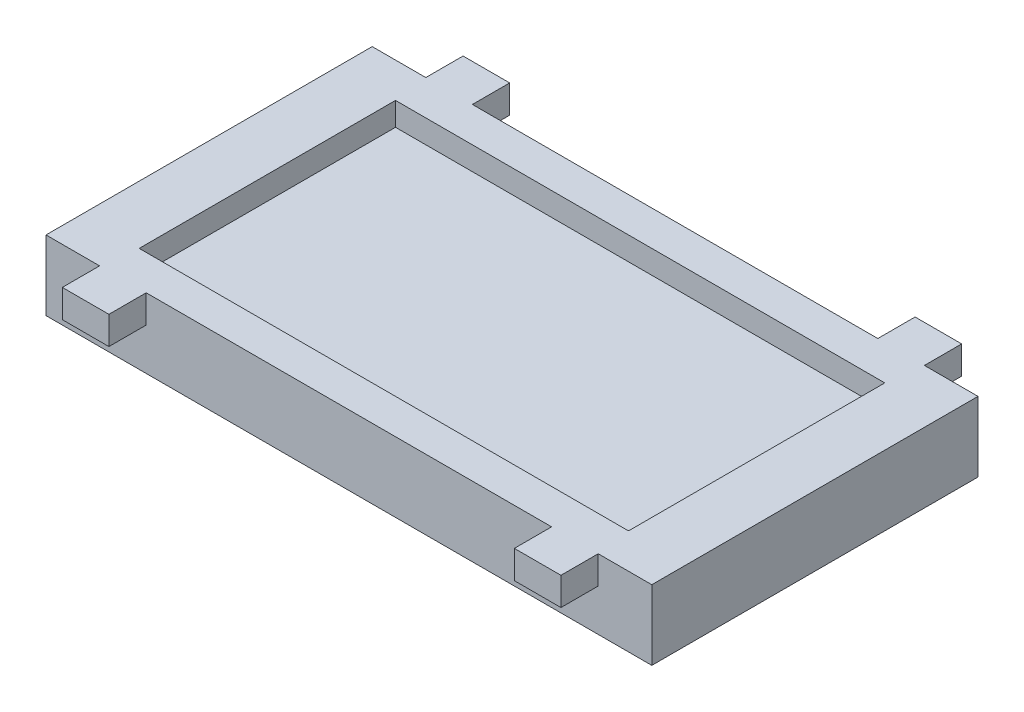
ISO-10303-21;
HEADER;
FILE_DESCRIPTION(('STEP AP214'),'2;1');
FILE_NAME('part.step','',(''),(''),'','','');
FILE_SCHEMA(('AUTOMOTIVE_DESIGN { 1 0 10303 214 1 1 1 1 }'));
ENDSEC;
DATA;
#1=APPLICATION_CONTEXT('core data for automotive mechanical design processes');
#2=APPLICATION_PROTOCOL_DEFINITION('international standard','automotive_design',2000,#1);
#3=PRODUCT_CONTEXT('',#1,'mechanical');
#4=PRODUCT('Part','Part','',(#3));
#5=PRODUCT_RELATED_PRODUCT_CATEGORY('part','',(#4));
#6=PRODUCT_DEFINITION_FORMATION('','',#4);
#7=PRODUCT_DEFINITION_CONTEXT('part definition',#1,'design');
#8=PRODUCT_DEFINITION('design','',#6,#7);
#9=PRODUCT_DEFINITION_SHAPE('','',#8);
#10=(LENGTH_UNIT() NAMED_UNIT(*) SI_UNIT(.MILLI.,.METRE.));
#11=(NAMED_UNIT(*) PLANE_ANGLE_UNIT() SI_UNIT($,.RADIAN.));
#12=(NAMED_UNIT(*) SI_UNIT($,.STERADIAN.) SOLID_ANGLE_UNIT());
#13=UNCERTAINTY_MEASURE_WITH_UNIT(LENGTH_MEASURE(1.E-05),#10,'distance_accuracy_value','');
#14=(GEOMETRIC_REPRESENTATION_CONTEXT(3) GLOBAL_UNCERTAINTY_ASSIGNED_CONTEXT((#13)) GLOBAL_UNIT_ASSIGNED_CONTEXT((#10,
#11,#12)) REPRESENTATION_CONTEXT('',''));
#15=CARTESIAN_POINT('',(0.,0.,0.));
#16=DIRECTION('',(0.,0.,1.));
#17=DIRECTION('',(1.,0.,0.));
#18=AXIS2_PLACEMENT_3D('',#15,#16,#17);
#19=CARTESIAN_POINT('',(-650.,150.,-350.));
#20=DIRECTION('',(0.,0.,1.));
#21=DIRECTION('',(1.,0.,0.));
#22=AXIS2_PLACEMENT_3D('',#19,#20,#21);
#23=PLANE('',#22);
#24=DIRECTION('',(-1.,0.,0.));
#25=VECTOR('',#24,1.);
#26=CARTESIAN_POINT('',(-650.,150.,-350.));
#27=LINE('',#26,#25);
#28=CARTESIAN_POINT('',(-535.,150.,-350.));
#29=VERTEX_POINT('',#28);
#30=CARTESIAN_POINT('',(-650.,150.,-350.));
#31=VERTEX_POINT('',#30);
#32=EDGE_CURVE('E554',#29,#31,#27,.T.);
#33=ORIENTED_EDGE('',*,*,#32,.F.);
#34=DIRECTION('',(0.,1.,0.));
#35=VECTOR('',#34,1.);
#36=CARTESIAN_POINT('',(-535.,90.,-350.));
#37=LINE('',#36,#35);
#38=CARTESIAN_POINT('',(-535.,90.,-350.));
#39=VERTEX_POINT('',#38);
#40=EDGE_CURVE('E267',#39,#29,#37,.T.);
#41=ORIENTED_EDGE('',*,*,#40,.F.);
#42=DIRECTION('',(1.,0.,0.));
#43=VECTOR('',#42,1.);
#44=CARTESIAN_POINT('',(-535.,90.,-350.));
#45=LINE('',#44,#43);
#46=CARTESIAN_POINT('',(-435.,90.,-350.));
#47=VERTEX_POINT('',#46);
#48=EDGE_CURVE('E279',#39,#47,#45,.T.);
#49=ORIENTED_EDGE('',*,*,#48,.T.);
#50=DIRECTION('',(0.,1.,0.));
#51=VECTOR('',#50,1.);
#52=CARTESIAN_POINT('',(-435.,90.,-350.));
#53=LINE('',#52,#51);
#54=CARTESIAN_POINT('',(-435.,150.,-350.));
#55=VERTEX_POINT('',#54);
#56=EDGE_CURVE('E293',#47,#55,#53,.T.);
#57=ORIENTED_EDGE('',*,*,#56,.T.);
#58=CARTESIAN_POINT('',(435.,150.,-350.));
#59=VERTEX_POINT('',#58);
#60=EDGE_CURVE('E561',#59,#55,#27,.T.);
#61=ORIENTED_EDGE('',*,*,#60,.F.);
#62=DIRECTION('',(0.,1.,0.));
#63=VECTOR('',#62,1.);
#64=CARTESIAN_POINT('',(435.,90.,-350.));
#65=LINE('',#64,#63);
#66=CARTESIAN_POINT('',(435.,90.,-350.));
#67=VERTEX_POINT('',#66);
#68=EDGE_CURVE('E316',#67,#59,#65,.T.);
#69=ORIENTED_EDGE('',*,*,#68,.F.);
#70=DIRECTION('',(1.,0.,0.));
#71=VECTOR('',#70,1.);
#72=CARTESIAN_POINT('',(435.,90.,-350.));
#73=LINE('',#72,#71);
#74=CARTESIAN_POINT('',(535.,90.,-350.));
#75=VERTEX_POINT('',#74);
#76=EDGE_CURVE('E303',#67,#75,#73,.T.);
#77=ORIENTED_EDGE('',*,*,#76,.T.);
#78=DIRECTION('',(0.,1.,0.));
#79=VECTOR('',#78,1.);
#80=CARTESIAN_POINT('',(535.,90.,-350.));
#81=LINE('',#80,#79);
#82=CARTESIAN_POINT('',(535.,150.,-350.));
#83=VERTEX_POINT('',#82);
#84=EDGE_CURVE('E332',#75,#83,#81,.T.);
#85=ORIENTED_EDGE('',*,*,#84,.T.);
#86=CARTESIAN_POINT('',(650.,150.,-350.));
#87=VERTEX_POINT('',#86);
#88=EDGE_CURVE('E556',#87,#83,#27,.T.);
#89=ORIENTED_EDGE('',*,*,#88,.F.);
#90=DIRECTION('',(0.,-1.,0.));
#91=VECTOR('',#90,1.);
#92=CARTESIAN_POINT('',(650.,150.,-350.));
#93=LINE('',#92,#91);
#94=CARTESIAN_POINT('',(650.,0.,-350.));
#95=VERTEX_POINT('',#94);
#96=EDGE_CURVE('E11',#87,#95,#93,.T.);
#97=ORIENTED_EDGE('',*,*,#96,.T.);
#98=DIRECTION('',(-1.,0.,0.));
#99=VECTOR('',#98,1.);
#100=CARTESIAN_POINT('',(-650.,0.,-350.));
#101=LINE('',#100,#99);
#102=CARTESIAN_POINT('',(-650.,0.,-350.));
#103=VERTEX_POINT('',#102);
#104=EDGE_CURVE('E574',#95,#103,#101,.T.);
#105=ORIENTED_EDGE('',*,*,#104,.T.);
#106=DIRECTION('',(0.,-1.,0.));
#107=VECTOR('',#106,1.);
#108=CARTESIAN_POINT('',(-650.,150.,-350.));
#109=LINE('',#108,#107);
#110=EDGE_CURVE('E54',#31,#103,#109,.T.);
#111=ORIENTED_EDGE('',*,*,#110,.F.);
#112=EDGE_LOOP('',(#33,#41,#49,#57,#61,#69,#77,#85,#89,#97,#105,#111));
#113=FACE_BOUND('',#112,.T.);
#114=ADVANCED_FACE('F45',(#113),#23,.F.);
#115=CARTESIAN_POINT('',(-650.,150.,350.));
#116=DIRECTION('',(0.,0.,-1.));
#117=DIRECTION('',(-1.,0.,0.));
#118=AXIS2_PLACEMENT_3D('',#115,#116,#117);
#119=PLANE('',#118);
#120=DIRECTION('',(1.,0.,0.));
#121=VECTOR('',#120,1.);
#122=CARTESIAN_POINT('',(-650.,150.,350.));
#123=LINE('',#122,#121);
#124=CARTESIAN_POINT('',(-435.,150.,350.));
#125=VERTEX_POINT('',#124);
#126=CARTESIAN_POINT('',(435.,150.,350.));
#127=VERTEX_POINT('',#126);
#128=EDGE_CURVE('E570',#125,#127,#123,.T.);
#129=ORIENTED_EDGE('',*,*,#128,.F.);
#130=DIRECTION('',(0.,1.,0.));
#131=VECTOR('',#130,1.);
#132=CARTESIAN_POINT('',(-435.,90.,350.));
#133=LINE('',#132,#131);
#134=CARTESIAN_POINT('',(-435.,90.,350.));
#135=VERTEX_POINT('',#134);
#136=EDGE_CURVE('E381',#135,#125,#133,.T.);
#137=ORIENTED_EDGE('',*,*,#136,.F.);
#138=DIRECTION('',(-1.,0.,0.));
#139=VECTOR('',#138,1.);
#140=CARTESIAN_POINT('',(-435.,90.,350.));
#141=LINE('',#140,#139);
#142=CARTESIAN_POINT('',(-535.,90.,350.));
#143=VERTEX_POINT('',#142);
#144=EDGE_CURVE('E415',#135,#143,#141,.T.);
#145=ORIENTED_EDGE('',*,*,#144,.T.);
#146=DIRECTION('',(0.,1.,0.));
#147=VECTOR('',#146,1.);
#148=CARTESIAN_POINT('',(-535.,90.,350.));
#149=LINE('',#148,#147);
#150=CARTESIAN_POINT('',(-535.,150.,350.));
#151=VERTEX_POINT('',#150);
#152=EDGE_CURVE('E386',#143,#151,#149,.T.);
#153=ORIENTED_EDGE('',*,*,#152,.T.);
#154=CARTESIAN_POINT('',(-650.,150.,350.));
#155=VERTEX_POINT('',#154);
#156=EDGE_CURVE('E565',#155,#151,#123,.T.);
#157=ORIENTED_EDGE('',*,*,#156,.F.);
#158=DIRECTION('',(0.,-1.,0.));
#159=VECTOR('',#158,1.);
#160=CARTESIAN_POINT('',(-650.,150.,350.));
#161=LINE('',#160,#159);
#162=CARTESIAN_POINT('',(-650.,0.,350.));
#163=VERTEX_POINT('',#162);
#164=EDGE_CURVE('E585',#155,#163,#161,.T.);
#165=ORIENTED_EDGE('',*,*,#164,.T.);
#166=DIRECTION('',(1.,0.,0.));
#167=VECTOR('',#166,1.);
#168=CARTESIAN_POINT('',(-650.,0.,350.));
#169=LINE('',#168,#167);
#170=CARTESIAN_POINT('',(650.,0.,350.));
#171=VERTEX_POINT('',#170);
#172=EDGE_CURVE('E555',#163,#171,#169,.T.);
#173=ORIENTED_EDGE('',*,*,#172,.T.);
#174=DIRECTION('',(0.,-1.,0.));
#175=VECTOR('',#174,1.);
#176=CARTESIAN_POINT('',(650.,150.,350.));
#177=LINE('',#176,#175);
#178=CARTESIAN_POINT('',(650.,150.,350.));
#179=VERTEX_POINT('',#178);
#180=EDGE_CURVE('E569',#179,#171,#177,.T.);
#181=ORIENTED_EDGE('',*,*,#180,.F.);
#182=CARTESIAN_POINT('',(535.,150.,350.));
#183=VERTEX_POINT('',#182);
#184=EDGE_CURVE('E564',#183,#179,#123,.T.);
#185=ORIENTED_EDGE('',*,*,#184,.F.);
#186=DIRECTION('',(0.,1.,0.));
#187=VECTOR('',#186,1.);
#188=CARTESIAN_POINT('',(535.,90.,350.));
#189=LINE('',#188,#187);
#190=CARTESIAN_POINT('',(535.,90.,350.));
#191=VERTEX_POINT('',#190);
#192=EDGE_CURVE('E450',#191,#183,#189,.T.);
#193=ORIENTED_EDGE('',*,*,#192,.F.);
#194=DIRECTION('',(-1.,0.,0.));
#195=VECTOR('',#194,1.);
#196=CARTESIAN_POINT('',(435.,90.,350.));
#197=LINE('',#196,#195);
#198=CARTESIAN_POINT('',(435.,90.,350.));
#199=VERTEX_POINT('',#198);
#200=EDGE_CURVE('E422',#191,#199,#197,.T.);
#201=ORIENTED_EDGE('',*,*,#200,.T.);
#202=DIRECTION('',(0.,1.,0.));
#203=VECTOR('',#202,1.);
#204=CARTESIAN_POINT('',(435.,90.,350.));
#205=LINE('',#204,#203);
#206=EDGE_CURVE('E439',#199,#127,#205,.T.);
#207=ORIENTED_EDGE('',*,*,#206,.T.);
#208=EDGE_LOOP('',(#129,#137,#145,#153,#157,#165,#173,#181,#185,#193,#201,#207));
#209=FACE_BOUND('',#208,.T.);
#210=ADVANCED_FACE('F604',(#209),#119,.F.);
#211=CARTESIAN_POINT('',(650.,150.,350.));
#212=DIRECTION('',(-1.,0.,0.));
#213=DIRECTION('',(0.,0.,1.));
#214=AXIS2_PLACEMENT_3D('',#211,#212,#213);
#215=PLANE('',#214);
#216=DIRECTION('',(0.,0.,-1.));
#217=VECTOR('',#216,1.);
#218=CARTESIAN_POINT('',(650.,0.,350.));
#219=LINE('',#218,#217);
#220=EDGE_CURVE('E541',#171,#95,#219,.T.);
#221=ORIENTED_EDGE('',*,*,#220,.T.);
#222=ORIENTED_EDGE('',*,*,#96,.F.);
#223=DIRECTION('',(0.,0.,-1.));
#224=VECTOR('',#223,1.);
#225=CARTESIAN_POINT('',(650.,150.,350.));
#226=LINE('',#225,#224);
#227=EDGE_CURVE('E551',#179,#87,#226,.T.);
#228=ORIENTED_EDGE('',*,*,#227,.F.);
#229=ORIENTED_EDGE('',*,*,#180,.T.);
#230=EDGE_LOOP('',(#221,#222,#228,#229));
#231=FACE_BOUND('',#230,.T.);
#232=ADVANCED_FACE('F47',(#231),#215,.F.);
#233=CARTESIAN_POINT('',(-650.,150.,350.));
#234=DIRECTION('',(1.,0.,0.));
#235=DIRECTION('',(0.,0.,-1.));
#236=AXIS2_PLACEMENT_3D('',#233,#234,#235);
#237=PLANE('',#236);
#238=DIRECTION('',(0.,0.,1.));
#239=VECTOR('',#238,1.);
#240=CARTESIAN_POINT('',(-650.,0.,350.));
#241=LINE('',#240,#239);
#242=EDGE_CURVE('E577',#103,#163,#241,.T.);
#243=ORIENTED_EDGE('',*,*,#242,.T.);
#244=ORIENTED_EDGE('',*,*,#164,.F.);
#245=DIRECTION('',(0.,0.,1.));
#246=VECTOR('',#245,1.);
#247=CARTESIAN_POINT('',(-650.,150.,350.));
#248=LINE('',#247,#246);
#249=EDGE_CURVE('E560',#31,#155,#248,.T.);
#250=ORIENTED_EDGE('',*,*,#249,.F.);
#251=ORIENTED_EDGE('',*,*,#110,.T.);
#252=EDGE_LOOP('',(#243,#244,#250,#251));
#253=FACE_BOUND('',#252,.T.);
#254=ADVANCED_FACE('F594',(#253),#237,.F.);
#255=CARTESIAN_POINT('',(0.,150.,0.));
#256=DIRECTION('',(0.,-1.,0.));
#257=DIRECTION('',(0.,0.,-1.));
#258=AXIS2_PLACEMENT_3D('',#255,#256,#257);
#259=PLANE('',#258);
#260=DIRECTION('',(-1.,0.,0.));
#261=VECTOR('',#260,1.);
#262=CARTESIAN_POINT('',(-525.,150.,-275.));
#263=LINE('',#262,#261);
#264=CARTESIAN_POINT('',(525.,150.,-275.));
#265=VERTEX_POINT('',#264);
#266=CARTESIAN_POINT('',(-525.,150.,-275.));
#267=VERTEX_POINT('',#266);
#268=EDGE_CURVE('E527',#265,#267,#263,.T.);
#269=ORIENTED_EDGE('',*,*,#268,.F.);
#270=DIRECTION('',(0.,0.,-1.));
#271=VECTOR('',#270,1.);
#272=CARTESIAN_POINT('',(525.,150.,275.));
#273=LINE('',#272,#271);
#274=CARTESIAN_POINT('',(525.,150.,275.));
#275=VERTEX_POINT('',#274);
#276=EDGE_CURVE('E497',#275,#265,#273,.T.);
#277=ORIENTED_EDGE('',*,*,#276,.F.);
#278=DIRECTION('',(1.,0.,0.));
#279=VECTOR('',#278,1.);
#280=CARTESIAN_POINT('',(-525.,150.,275.));
#281=LINE('',#280,#279);
#282=CARTESIAN_POINT('',(-525.,150.,275.));
#283=VERTEX_POINT('',#282);
#284=EDGE_CURVE('E512',#283,#275,#281,.T.);
#285=ORIENTED_EDGE('',*,*,#284,.F.);
#286=DIRECTION('',(0.,0.,1.));
#287=VECTOR('',#286,1.);
#288=CARTESIAN_POINT('',(-525.,150.,275.));
#289=LINE('',#288,#287);
#290=EDGE_CURVE('E531',#267,#283,#289,.T.);
#291=ORIENTED_EDGE('',*,*,#290,.F.);
#292=EDGE_LOOP('',(#269,#277,#285,#291));
#293=FACE_BOUND('',#292,.T.);
#294=ORIENTED_EDGE('',*,*,#227,.T.);
#295=ORIENTED_EDGE('',*,*,#88,.T.);
#296=DIRECTION('',(0.,0.,-1.));
#297=VECTOR('',#296,1.);
#298=CARTESIAN_POINT('',(535.,150.,-430.));
#299=LINE('',#298,#297);
#300=CARTESIAN_POINT('',(535.,150.,-430.));
#301=VERTEX_POINT('',#300);
#302=EDGE_CURVE('E69',#83,#301,#299,.T.);
#303=ORIENTED_EDGE('',*,*,#302,.T.);
#304=DIRECTION('',(-1.,0.,0.));
#305=VECTOR('',#304,1.);
#306=CARTESIAN_POINT('',(535.,150.,-430.));
#307=LINE('',#306,#305);
#308=CARTESIAN_POINT('',(435.,150.,-430.));
#309=VERTEX_POINT('',#308);
#310=EDGE_CURVE('E304',#301,#309,#307,.T.);
#311=ORIENTED_EDGE('',*,*,#310,.T.);
#312=DIRECTION('',(0.,0.,1.));
#313=VECTOR('',#312,1.);
#314=CARTESIAN_POINT('',(435.,150.,-430.));
#315=LINE('',#314,#313);
#316=EDGE_CURVE('E289',#309,#59,#315,.T.);
#317=ORIENTED_EDGE('',*,*,#316,.T.);
#318=ORIENTED_EDGE('',*,*,#60,.T.);
#319=DIRECTION('',(0.,0.,-1.));
#320=VECTOR('',#319,1.);
#321=CARTESIAN_POINT('',(-435.,150.,-350.));
#322=LINE('',#321,#320);
#323=CARTESIAN_POINT('',(-435.,150.,-430.));
#324=VERTEX_POINT('',#323);
#325=EDGE_CURVE('E272',#55,#324,#322,.T.);
#326=ORIENTED_EDGE('',*,*,#325,.T.);
#327=DIRECTION('',(-1.,0.,0.));
#328=VECTOR('',#327,1.);
#329=CARTESIAN_POINT('',(-435.,150.,-430.));
#330=LINE('',#329,#328);
#331=CARTESIAN_POINT('',(-535.,150.,-430.));
#332=VERTEX_POINT('',#331);
#333=EDGE_CURVE('E258',#324,#332,#330,.T.);
#334=ORIENTED_EDGE('',*,*,#333,.T.);
#335=DIRECTION('',(0.,0.,1.));
#336=VECTOR('',#335,1.);
#337=CARTESIAN_POINT('',(-535.,150.,-430.));
#338=LINE('',#337,#336);
#339=EDGE_CURVE('E61',#332,#29,#338,.T.);
#340=ORIENTED_EDGE('',*,*,#339,.T.);
#341=ORIENTED_EDGE('',*,*,#32,.T.);
#342=ORIENTED_EDGE('',*,*,#249,.T.);
#343=ORIENTED_EDGE('',*,*,#156,.T.);
#344=DIRECTION('',(0.,0.,1.));
#345=VECTOR('',#344,1.);
#346=CARTESIAN_POINT('',(-535.,150.,350.));
#347=LINE('',#346,#345);
#348=CARTESIAN_POINT('',(-535.,150.,430.));
#349=VERTEX_POINT('',#348);
#350=EDGE_CURVE('E399',#151,#349,#347,.T.);
#351=ORIENTED_EDGE('',*,*,#350,.T.);
#352=DIRECTION('',(1.,0.,0.));
#353=VECTOR('',#352,1.);
#354=CARTESIAN_POINT('',(-535.,150.,430.));
#355=LINE('',#354,#353);
#356=CARTESIAN_POINT('',(-435.,150.,430.));
#357=VERTEX_POINT('',#356);
#358=EDGE_CURVE('E395',#349,#357,#355,.T.);
#359=ORIENTED_EDGE('',*,*,#358,.T.);
#360=DIRECTION('',(0.,0.,-1.));
#361=VECTOR('',#360,1.);
#362=CARTESIAN_POINT('',(-435.,150.,430.));
#363=LINE('',#362,#361);
#364=EDGE_CURVE('E404',#357,#125,#363,.T.);
#365=ORIENTED_EDGE('',*,*,#364,.T.);
#366=ORIENTED_EDGE('',*,*,#128,.T.);
#367=DIRECTION('',(0.,0.,1.));
#368=VECTOR('',#367,1.);
#369=CARTESIAN_POINT('',(435.,150.,430.));
#370=LINE('',#369,#368);
#371=CARTESIAN_POINT('',(435.,150.,430.));
#372=VERTEX_POINT('',#371);
#373=EDGE_CURVE('E407',#127,#372,#370,.T.);
#374=ORIENTED_EDGE('',*,*,#373,.T.);
#375=DIRECTION('',(1.,0.,0.));
#376=VECTOR('',#375,1.);
#377=CARTESIAN_POINT('',(535.,150.,430.));
#378=LINE('',#377,#376);
#379=CARTESIAN_POINT('',(535.,150.,430.));
#380=VERTEX_POINT('',#379);
#381=EDGE_CURVE('E443',#372,#380,#378,.T.);
#382=ORIENTED_EDGE('',*,*,#381,.T.);
#383=DIRECTION('',(0.,0.,-1.));
#384=VECTOR('',#383,1.);
#385=CARTESIAN_POINT('',(535.,150.,350.));
#386=LINE('',#385,#384);
#387=EDGE_CURVE('E427',#380,#183,#386,.T.);
#388=ORIENTED_EDGE('',*,*,#387,.T.);
#389=ORIENTED_EDGE('',*,*,#184,.T.);
#390=EDGE_LOOP('',(#294,#295,#303,#311,#317,#318,#326,#334,#340,#341,#342,#343,#351,#359,#365,
#366,#374,#382,#388,#389));
#391=FACE_BOUND('',#390,.T.);
#392=ADVANCED_FACE('F270',(#293,#391),#259,.F.);
#393=CARTESIAN_POINT('',(0.,0.,0.));
#394=DIRECTION('',(0.,-1.,0.));
#395=DIRECTION('',(0.,0.,-1.));
#396=AXIS2_PLACEMENT_3D('',#393,#394,#395);
#397=PLANE('',#396);
#398=DIRECTION('',(0.,0.,1.));
#399=VECTOR('',#398,1.);
#400=CARTESIAN_POINT('',(525.,0.,275.));
#401=LINE('',#400,#399);
#402=CARTESIAN_POINT('',(525.,0.,-275.));
#403=VERTEX_POINT('',#402);
#404=CARTESIAN_POINT('',(525.,0.,275.));
#405=VERTEX_POINT('',#404);
#406=EDGE_CURVE('E453',#403,#405,#401,.T.);
#407=ORIENTED_EDGE('',*,*,#406,.F.);
#408=DIRECTION('',(1.,0.,0.));
#409=VECTOR('',#408,1.);
#410=CARTESIAN_POINT('',(-525.,0.,-275.));
#411=LINE('',#410,#409);
#412=CARTESIAN_POINT('',(-525.,0.,-275.));
#413=VERTEX_POINT('',#412);
#414=EDGE_CURVE('E468',#413,#403,#411,.T.);
#415=ORIENTED_EDGE('',*,*,#414,.F.);
#416=DIRECTION('',(0.,0.,-1.));
#417=VECTOR('',#416,1.);
#418=CARTESIAN_POINT('',(-525.,0.,275.));
#419=LINE('',#418,#417);
#420=CARTESIAN_POINT('',(-525.,0.,275.));
#421=VERTEX_POINT('',#420);
#422=EDGE_CURVE('E487',#421,#413,#419,.T.);
#423=ORIENTED_EDGE('',*,*,#422,.F.);
#424=DIRECTION('',(-1.,0.,0.));
#425=VECTOR('',#424,1.);
#426=CARTESIAN_POINT('',(-525.,0.,275.));
#427=LINE('',#426,#425);
#428=EDGE_CURVE('E483',#405,#421,#427,.T.);
#429=ORIENTED_EDGE('',*,*,#428,.F.);
#430=EDGE_LOOP('',(#407,#415,#423,#429));
#431=FACE_BOUND('',#430,.T.);
#432=ORIENTED_EDGE('',*,*,#220,.F.);
#433=ORIENTED_EDGE('',*,*,#172,.F.);
#434=ORIENTED_EDGE('',*,*,#242,.F.);
#435=ORIENTED_EDGE('',*,*,#104,.F.);
#436=EDGE_LOOP('',(#432,#433,#434,#435));
#437=FACE_BOUND('',#436,.T.);
#438=ADVANCED_FACE('F600',(#431,#437),#397,.T.);
#439=CARTESIAN_POINT('',(525.,100.,275.));
#440=DIRECTION('',(1.,0.,0.));
#441=DIRECTION('',(0.,0.,-1.));
#442=AXIS2_PLACEMENT_3D('',#439,#440,#441);
#443=PLANE('',#442);
#444=ORIENTED_EDGE('',*,*,#276,.T.);
#445=DIRECTION('',(0.,1.,0.));
#446=VECTOR('',#445,1.);
#447=CARTESIAN_POINT('',(525.,100.,-275.));
#448=LINE('',#447,#446);
#449=CARTESIAN_POINT('',(525.,100.,-275.));
#450=VERTEX_POINT('',#449);
#451=EDGE_CURVE('E524',#450,#265,#448,.T.);
#452=ORIENTED_EDGE('',*,*,#451,.F.);
#453=DIRECTION('',(0.,0.,-1.));
#454=VECTOR('',#453,1.);
#455=CARTESIAN_POINT('',(525.,100.,275.));
#456=LINE('',#455,#454);
#457=CARTESIAN_POINT('',(525.,100.,275.));
#458=VERTEX_POINT('',#457);
#459=EDGE_CURVE('E507',#458,#450,#456,.T.);
#460=ORIENTED_EDGE('',*,*,#459,.F.);
#461=DIRECTION('',(0.,1.,0.));
#462=VECTOR('',#461,1.);
#463=CARTESIAN_POINT('',(525.,100.,275.));
#464=LINE('',#463,#462);
#465=EDGE_CURVE('E538',#458,#275,#464,.T.);
#466=ORIENTED_EDGE('',*,*,#465,.T.);
#467=EDGE_LOOP('',(#444,#452,#460,#466));
#468=FACE_BOUND('',#467,.T.);
#469=ADVANCED_FACE('F648',(#468),#443,.F.);
#470=CARTESIAN_POINT('',(-525.,100.,275.));
#471=DIRECTION('',(0.,0.,1.));
#472=DIRECTION('',(1.,0.,0.));
#473=AXIS2_PLACEMENT_3D('',#470,#471,#472);
#474=PLANE('',#473);
#475=ORIENTED_EDGE('',*,*,#284,.T.);
#476=ORIENTED_EDGE('',*,*,#465,.F.);
#477=DIRECTION('',(1.,0.,0.));
#478=VECTOR('',#477,1.);
#479=CARTESIAN_POINT('',(-525.,100.,275.));
#480=LINE('',#479,#478);
#481=CARTESIAN_POINT('',(-525.,100.,275.));
#482=VERTEX_POINT('',#481);
#483=EDGE_CURVE('E520',#482,#458,#480,.T.);
#484=ORIENTED_EDGE('',*,*,#483,.F.);
#485=DIRECTION('',(0.,1.,0.));
#486=VECTOR('',#485,1.);
#487=CARTESIAN_POINT('',(-525.,100.,275.));
#488=LINE('',#487,#486);
#489=EDGE_CURVE('E542',#482,#283,#488,.T.);
#490=ORIENTED_EDGE('',*,*,#489,.T.);
#491=EDGE_LOOP('',(#475,#476,#484,#490));
#492=FACE_BOUND('',#491,.T.);
#493=ADVANCED_FACE('F655',(#492),#474,.F.);
#494=CARTESIAN_POINT('',(-525.,100.,275.));
#495=DIRECTION('',(-1.,0.,0.));
#496=DIRECTION('',(0.,0.,1.));
#497=AXIS2_PLACEMENT_3D('',#494,#495,#496);
#498=PLANE('',#497);
#499=ORIENTED_EDGE('',*,*,#290,.T.);
#500=ORIENTED_EDGE('',*,*,#489,.F.);
#501=DIRECTION('',(0.,0.,1.));
#502=VECTOR('',#501,1.);
#503=CARTESIAN_POINT('',(-525.,100.,275.));
#504=LINE('',#503,#502);
#505=CARTESIAN_POINT('',(-525.,100.,-275.));
#506=VERTEX_POINT('',#505);
#507=EDGE_CURVE('E516',#506,#482,#504,.T.);
#508=ORIENTED_EDGE('',*,*,#507,.F.);
#509=DIRECTION('',(0.,1.,0.));
#510=VECTOR('',#509,1.);
#511=CARTESIAN_POINT('',(-525.,100.,-275.));
#512=LINE('',#511,#510);
#513=EDGE_CURVE('E545',#506,#267,#512,.T.);
#514=ORIENTED_EDGE('',*,*,#513,.T.);
#515=EDGE_LOOP('',(#499,#500,#508,#514));
#516=FACE_BOUND('',#515,.T.);
#517=ADVANCED_FACE('F661',(#516),#498,.F.);
#518=CARTESIAN_POINT('',(-525.,100.,-275.));
#519=DIRECTION('',(0.,0.,-1.));
#520=DIRECTION('',(-1.,0.,0.));
#521=AXIS2_PLACEMENT_3D('',#518,#519,#520);
#522=PLANE('',#521);
#523=ORIENTED_EDGE('',*,*,#268,.T.);
#524=ORIENTED_EDGE('',*,*,#513,.F.);
#525=DIRECTION('',(-1.,0.,0.));
#526=VECTOR('',#525,1.);
#527=CARTESIAN_POINT('',(-525.,100.,-275.));
#528=LINE('',#527,#526);
#529=EDGE_CURVE('E511',#450,#506,#528,.T.);
#530=ORIENTED_EDGE('',*,*,#529,.F.);
#531=ORIENTED_EDGE('',*,*,#451,.T.);
#532=EDGE_LOOP('',(#523,#524,#530,#531));
#533=FACE_BOUND('',#532,.T.);
#534=ADVANCED_FACE('F657',(#533),#522,.F.);
#535=CARTESIAN_POINT('',(0.,100.,0.));
#536=DIRECTION('',(0.,-1.,0.));
#537=DIRECTION('',(0.,0.,-1.));
#538=AXIS2_PLACEMENT_3D('',#535,#536,#537);
#539=PLANE('',#538);
#540=ORIENTED_EDGE('',*,*,#459,.T.);
#541=ORIENTED_EDGE('',*,*,#529,.T.);
#542=ORIENTED_EDGE('',*,*,#507,.T.);
#543=ORIENTED_EDGE('',*,*,#483,.T.);
#544=EDGE_LOOP('',(#540,#541,#542,#543));
#545=FACE_BOUND('',#544,.T.);
#546=ADVANCED_FACE('F660',(#545),#539,.F.);
#547=CARTESIAN_POINT('',(525.,50.,275.));
#548=DIRECTION('',(1.,0.,0.));
#549=DIRECTION('',(0.,0.,-1.));
#550=AXIS2_PLACEMENT_3D('',#547,#548,#549);
#551=PLANE('',#550);
#552=ORIENTED_EDGE('',*,*,#406,.T.);
#553=DIRECTION('',(0.,-1.,0.));
#554=VECTOR('',#553,1.);
#555=CARTESIAN_POINT('',(525.,50.,275.));
#556=LINE('',#555,#554);
#557=CARTESIAN_POINT('',(525.,50.,275.));
#558=VERTEX_POINT('',#557);
#559=EDGE_CURVE('E480',#558,#405,#556,.T.);
#560=ORIENTED_EDGE('',*,*,#559,.F.);
#561=DIRECTION('',(0.,0.,1.));
#562=VECTOR('',#561,1.);
#563=CARTESIAN_POINT('',(525.,50.,275.));
#564=LINE('',#563,#562);
#565=CARTESIAN_POINT('',(525.,50.,-275.));
#566=VERTEX_POINT('',#565);
#567=EDGE_CURVE('E463',#566,#558,#564,.T.);
#568=ORIENTED_EDGE('',*,*,#567,.F.);
#569=DIRECTION('',(0.,-1.,0.));
#570=VECTOR('',#569,1.);
#571=CARTESIAN_POINT('',(525.,50.,-275.));
#572=LINE('',#571,#570);
#573=EDGE_CURVE('E494',#566,#403,#572,.T.);
#574=ORIENTED_EDGE('',*,*,#573,.T.);
#575=EDGE_LOOP('',(#552,#560,#568,#574));
#576=FACE_BOUND('',#575,.T.);
#577=ADVANCED_FACE('F671',(#576),#551,.F.);
#578=CARTESIAN_POINT('',(-525.,50.,-275.));
#579=DIRECTION('',(0.,0.,-1.));
#580=DIRECTION('',(-1.,0.,0.));
#581=AXIS2_PLACEMENT_3D('',#578,#579,#580);
#582=PLANE('',#581);
#583=ORIENTED_EDGE('',*,*,#414,.T.);
#584=ORIENTED_EDGE('',*,*,#573,.F.);
#585=DIRECTION('',(1.,0.,0.));
#586=VECTOR('',#585,1.);
#587=CARTESIAN_POINT('',(-525.,50.,-275.));
#588=LINE('',#587,#586);
#589=CARTESIAN_POINT('',(-525.,50.,-275.));
#590=VERTEX_POINT('',#589);
#591=EDGE_CURVE('E476',#590,#566,#588,.T.);
#592=ORIENTED_EDGE('',*,*,#591,.F.);
#593=DIRECTION('',(0.,-1.,0.));
#594=VECTOR('',#593,1.);
#595=CARTESIAN_POINT('',(-525.,50.,-275.));
#596=LINE('',#595,#594);
#597=EDGE_CURVE('E498',#590,#413,#596,.T.);
#598=ORIENTED_EDGE('',*,*,#597,.T.);
#599=EDGE_LOOP('',(#583,#584,#592,#598));
#600=FACE_BOUND('',#599,.T.);
#601=ADVANCED_FACE('F675',(#600),#582,.F.);
#602=CARTESIAN_POINT('',(-525.,50.,275.));
#603=DIRECTION('',(-1.,0.,0.));
#604=DIRECTION('',(0.,0.,1.));
#605=AXIS2_PLACEMENT_3D('',#602,#603,#604);
#606=PLANE('',#605);
#607=ORIENTED_EDGE('',*,*,#422,.T.);
#608=ORIENTED_EDGE('',*,*,#597,.F.);
#609=DIRECTION('',(0.,0.,-1.));
#610=VECTOR('',#609,1.);
#611=CARTESIAN_POINT('',(-525.,50.,275.));
#612=LINE('',#611,#610);
#613=CARTESIAN_POINT('',(-525.,50.,275.));
#614=VERTEX_POINT('',#613);
#615=EDGE_CURVE('E472',#614,#590,#612,.T.);
#616=ORIENTED_EDGE('',*,*,#615,.F.);
#617=DIRECTION('',(0.,-1.,0.));
#618=VECTOR('',#617,1.);
#619=CARTESIAN_POINT('',(-525.,50.,275.));
#620=LINE('',#619,#618);
#621=EDGE_CURVE('E501',#614,#421,#620,.T.);
#622=ORIENTED_EDGE('',*,*,#621,.T.);
#623=EDGE_LOOP('',(#607,#608,#616,#622));
#624=FACE_BOUND('',#623,.T.);
#625=ADVANCED_FACE('F680',(#624),#606,.F.);
#626=CARTESIAN_POINT('',(-525.,50.,275.));
#627=DIRECTION('',(0.,0.,1.));
#628=DIRECTION('',(1.,0.,0.));
#629=AXIS2_PLACEMENT_3D('',#626,#627,#628);
#630=PLANE('',#629);
#631=ORIENTED_EDGE('',*,*,#428,.T.);
#632=ORIENTED_EDGE('',*,*,#621,.F.);
#633=DIRECTION('',(-1.,0.,0.));
#634=VECTOR('',#633,1.);
#635=CARTESIAN_POINT('',(-525.,50.,275.));
#636=LINE('',#635,#634);
#637=EDGE_CURVE('E467',#558,#614,#636,.T.);
#638=ORIENTED_EDGE('',*,*,#637,.F.);
#639=ORIENTED_EDGE('',*,*,#559,.T.);
#640=EDGE_LOOP('',(#631,#632,#638,#639));
#641=FACE_BOUND('',#640,.T.);
#642=ADVANCED_FACE('F677',(#641),#630,.F.);
#643=CARTESIAN_POINT('',(0.,50.,0.));
#644=DIRECTION('',(0.,-1.,0.));
#645=DIRECTION('',(0.,0.,-1.));
#646=AXIS2_PLACEMENT_3D('',#643,#644,#645);
#647=PLANE('',#646);
#648=ORIENTED_EDGE('',*,*,#567,.T.);
#649=ORIENTED_EDGE('',*,*,#637,.T.);
#650=ORIENTED_EDGE('',*,*,#615,.T.);
#651=ORIENTED_EDGE('',*,*,#591,.T.);
#652=EDGE_LOOP('',(#648,#649,#650,#651));
#653=FACE_BOUND('',#652,.T.);
#654=ADVANCED_FACE('F636',(#653),#647,.T.);
#655=CARTESIAN_POINT('',(535.,90.,350.));
#656=DIRECTION('',(1.,0.,0.));
#657=DIRECTION('',(0.,0.,-1.));
#658=AXIS2_PLACEMENT_3D('',#655,#656,#657);
#659=PLANE('',#658);
#660=ORIENTED_EDGE('',*,*,#387,.F.);
#661=DIRECTION('',(0.,1.,0.));
#662=VECTOR('',#661,1.);
#663=CARTESIAN_POINT('',(535.,90.,430.));
#664=LINE('',#663,#662);
#665=CARTESIAN_POINT('',(535.,90.,430.));
#666=VERTEX_POINT('',#665);
#667=EDGE_CURVE('E454',#666,#380,#664,.T.);
#668=ORIENTED_EDGE('',*,*,#667,.F.);
#669=DIRECTION('',(0.,0.,-1.));
#670=VECTOR('',#669,1.);
#671=CARTESIAN_POINT('',(535.,90.,350.));
#672=LINE('',#671,#670);
#673=EDGE_CURVE('E435',#666,#191,#672,.T.);
#674=ORIENTED_EDGE('',*,*,#673,.T.);
#675=ORIENTED_EDGE('',*,*,#192,.T.);
#676=EDGE_LOOP('',(#660,#668,#674,#675));
#677=FACE_BOUND('',#676,.T.);
#678=ADVANCED_FACE('F626',(#677),#659,.T.);
#679=CARTESIAN_POINT('',(535.,90.,430.));
#680=DIRECTION('',(0.,0.,1.));
#681=DIRECTION('',(1.,0.,0.));
#682=AXIS2_PLACEMENT_3D('',#679,#680,#681);
#683=PLANE('',#682);
#684=ORIENTED_EDGE('',*,*,#381,.F.);
#685=DIRECTION('',(0.,1.,0.));
#686=VECTOR('',#685,1.);
#687=CARTESIAN_POINT('',(435.,90.,430.));
#688=LINE('',#687,#686);
#689=CARTESIAN_POINT('',(435.,90.,430.));
#690=VERTEX_POINT('',#689);
#691=EDGE_CURVE('E457',#690,#372,#688,.T.);
#692=ORIENTED_EDGE('',*,*,#691,.F.);
#693=DIRECTION('',(1.,0.,0.));
#694=VECTOR('',#693,1.);
#695=CARTESIAN_POINT('',(535.,90.,430.));
#696=LINE('',#695,#694);
#697=EDGE_CURVE('E431',#690,#666,#696,.T.);
#698=ORIENTED_EDGE('',*,*,#697,.T.);
#699=ORIENTED_EDGE('',*,*,#667,.T.);
#700=EDGE_LOOP('',(#684,#692,#698,#699));
#701=FACE_BOUND('',#700,.T.);
#702=ADVANCED_FACE('F628',(#701),#683,.T.);
#703=CARTESIAN_POINT('',(435.,90.,430.));
#704=DIRECTION('',(-1.,0.,0.));
#705=DIRECTION('',(0.,0.,1.));
#706=AXIS2_PLACEMENT_3D('',#703,#704,#705);
#707=PLANE('',#706);
#708=ORIENTED_EDGE('',*,*,#373,.F.);
#709=ORIENTED_EDGE('',*,*,#206,.F.);
#710=DIRECTION('',(0.,0.,1.));
#711=VECTOR('',#710,1.);
#712=CARTESIAN_POINT('',(435.,90.,430.));
#713=LINE('',#712,#711);
#714=EDGE_CURVE('E426',#199,#690,#713,.T.);
#715=ORIENTED_EDGE('',*,*,#714,.T.);
#716=ORIENTED_EDGE('',*,*,#691,.T.);
#717=EDGE_LOOP('',(#708,#709,#715,#716));
#718=FACE_BOUND('',#717,.T.);
#719=ADVANCED_FACE('F618',(#718),#707,.T.);
#720=CARTESIAN_POINT('',(0.,90.,0.));
#721=DIRECTION('',(0.,-1.,0.));
#722=DIRECTION('',(0.,0.,-1.));
#723=AXIS2_PLACEMENT_3D('',#720,#721,#722);
#724=PLANE('',#723);
#725=DIRECTION('',(0.,0.,1.));
#726=VECTOR('',#725,1.);
#727=CARTESIAN_POINT('',(532.087200578599,90.,362.424483471284));
#728=LINE('',#727,#726);
#729=CARTESIAN_POINT('',(532.087200578599,90.,362.424483471284));
#730=VERTEX_POINT('',#729);
#731=CARTESIAN_POINT('',(532.087200578599,90.,417.424483471284));
#732=VERTEX_POINT('',#731);
#733=EDGE_CURVE('E328',#730,#732,#728,.T.);
#734=ORIENTED_EDGE('',*,*,#733,.F.);
#735=DIRECTION('',(1.,0.,0.));
#736=VECTOR('',#735,1.);
#737=CARTESIAN_POINT('',(439.087200578599,90.,362.424483471284));
#738=LINE('',#737,#736);
#739=CARTESIAN_POINT('',(439.087200578599,90.,362.424483471284));
#740=VERTEX_POINT('',#739);
#741=EDGE_CURVE('E342',#740,#730,#738,.T.);
#742=ORIENTED_EDGE('',*,*,#741,.F.);
#743=DIRECTION('',(0.,0.,-1.));
#744=VECTOR('',#743,1.);
#745=CARTESIAN_POINT('',(439.087200578599,90.,362.424483471284));
#746=LINE('',#745,#744);
#747=CARTESIAN_POINT('',(439.087200578599,90.,417.424483471284));
#748=VERTEX_POINT('',#747);
#749=EDGE_CURVE('E361',#748,#740,#746,.T.);
#750=ORIENTED_EDGE('',*,*,#749,.F.);
#751=DIRECTION('',(-1.,0.,0.));
#752=VECTOR('',#751,1.);
#753=CARTESIAN_POINT('',(439.087200578599,90.,417.424483471284));
#754=LINE('',#753,#752);
#755=EDGE_CURVE('E357',#732,#748,#754,.T.);
#756=ORIENTED_EDGE('',*,*,#755,.F.);
#757=EDGE_LOOP('',(#734,#742,#750,#756));
#758=FACE_BOUND('',#757,.T.);
#759=ORIENTED_EDGE('',*,*,#200,.F.);
#760=ORIENTED_EDGE('',*,*,#673,.F.);
#761=ORIENTED_EDGE('',*,*,#697,.F.);
#762=ORIENTED_EDGE('',*,*,#714,.F.);
#763=EDGE_LOOP('',(#759,#760,#761,#762));
#764=FACE_BOUND('',#763,.T.);
#765=ADVANCED_FACE('F623',(#758,#764),#724,.T.);
#766=CARTESIAN_POINT('',(-435.,90.,430.));
#767=DIRECTION('',(1.,0.,0.));
#768=DIRECTION('',(0.,0.,-1.));
#769=AXIS2_PLACEMENT_3D('',#766,#767,#768);
#770=PLANE('',#769);
#771=ORIENTED_EDGE('',*,*,#364,.F.);
#772=DIRECTION('',(0.,1.,0.));
#773=VECTOR('',#772,1.);
#774=CARTESIAN_POINT('',(-435.,90.,430.));
#775=LINE('',#774,#773);
#776=CARTESIAN_POINT('',(-435.,90.,430.));
#777=VERTEX_POINT('',#776);
#778=EDGE_CURVE('E371',#777,#357,#775,.T.);
#779=ORIENTED_EDGE('',*,*,#778,.F.);
#780=DIRECTION('',(0.,0.,-1.));
#781=VECTOR('',#780,1.);
#782=CARTESIAN_POINT('',(-435.,90.,430.));
#783=LINE('',#782,#781);
#784=EDGE_CURVE('E400',#777,#135,#783,.T.);
#785=ORIENTED_EDGE('',*,*,#784,.T.);
#786=ORIENTED_EDGE('',*,*,#136,.T.);
#787=EDGE_LOOP('',(#771,#779,#785,#786));
#788=FACE_BOUND('',#787,.T.);
#789=ADVANCED_FACE('F730',(#788),#770,.T.);
#790=CARTESIAN_POINT('',(-535.,90.,430.));
#791=DIRECTION('',(0.,0.,1.));
#792=DIRECTION('',(1.,0.,0.));
#793=AXIS2_PLACEMENT_3D('',#790,#791,#792);
#794=PLANE('',#793);
#795=ORIENTED_EDGE('',*,*,#358,.F.);
#796=DIRECTION('',(0.,1.,0.));
#797=VECTOR('',#796,1.);
#798=CARTESIAN_POINT('',(-535.,90.,430.));
#799=LINE('',#798,#797);
#800=CARTESIAN_POINT('',(-535.,90.,430.));
#801=VERTEX_POINT('',#800);
#802=EDGE_CURVE('E390',#801,#349,#799,.T.);
#803=ORIENTED_EDGE('',*,*,#802,.F.);
#804=DIRECTION('',(1.,0.,0.));
#805=VECTOR('',#804,1.);
#806=CARTESIAN_POINT('',(-535.,90.,430.));
#807=LINE('',#806,#805);
#808=EDGE_CURVE('E385',#801,#777,#807,.T.);
#809=ORIENTED_EDGE('',*,*,#808,.T.);
#810=ORIENTED_EDGE('',*,*,#778,.T.);
#811=EDGE_LOOP('',(#795,#803,#809,#810));
#812=FACE_BOUND('',#811,.T.);
#813=ADVANCED_FACE('F735',(#812),#794,.T.);
#814=CARTESIAN_POINT('',(-535.,90.,350.));
#815=DIRECTION('',(-1.,0.,0.));
#816=DIRECTION('',(0.,0.,1.));
#817=AXIS2_PLACEMENT_3D('',#814,#815,#816);
#818=PLANE('',#817);
#819=ORIENTED_EDGE('',*,*,#350,.F.);
#820=ORIENTED_EDGE('',*,*,#152,.F.);
#821=DIRECTION('',(0.,0.,1.));
#822=VECTOR('',#821,1.);
#823=CARTESIAN_POINT('',(-535.,90.,350.));
#824=LINE('',#823,#822);
#825=EDGE_CURVE('E411',#143,#801,#824,.T.);
#826=ORIENTED_EDGE('',*,*,#825,.T.);
#827=ORIENTED_EDGE('',*,*,#802,.T.);
#828=EDGE_LOOP('',(#819,#820,#826,#827));
#829=FACE_BOUND('',#828,.T.);
#830=ADVANCED_FACE('F746',(#829),#818,.T.);
#831=CARTESIAN_POINT('',(0.,90.,0.));
#832=DIRECTION('',(0.,1.,0.));
#833=DIRECTION('',(0.,0.,1.));
#834=AXIS2_PLACEMENT_3D('',#831,#832,#833);
#835=PLANE('',#834);
#836=ORIENTED_EDGE('',*,*,#784,.F.);
#837=ORIENTED_EDGE('',*,*,#808,.F.);
#838=ORIENTED_EDGE('',*,*,#825,.F.);
#839=ORIENTED_EDGE('',*,*,#144,.F.);
#840=EDGE_LOOP('',(#836,#837,#838,#839));
#841=FACE_BOUND('',#840,.T.);
#842=ADVANCED_FACE('F757',(#841),#835,.F.);
#843=CARTESIAN_POINT('',(532.087200578599,130.,362.424483471284));
#844=DIRECTION('',(1.,0.,0.));
#845=DIRECTION('',(0.,0.,-1.));
#846=AXIS2_PLACEMENT_3D('',#843,#844,#845);
#847=PLANE('',#846);
#848=ORIENTED_EDGE('',*,*,#733,.T.);
#849=DIRECTION('',(0.,-1.,0.));
#850=VECTOR('',#849,1.);
#851=CARTESIAN_POINT('',(532.087200578599,130.,417.424483471284));
#852=LINE('',#851,#850);
#853=CARTESIAN_POINT('',(532.087200578599,130.,417.424483471284));
#854=VERTEX_POINT('',#853);
#855=EDGE_CURVE('E354',#854,#732,#852,.T.);
#856=ORIENTED_EDGE('',*,*,#855,.F.);
#857=DIRECTION('',(0.,0.,1.));
#858=VECTOR('',#857,1.);
#859=CARTESIAN_POINT('',(532.087200578599,130.,362.424483471284));
#860=LINE('',#859,#858);
#861=CARTESIAN_POINT('',(532.087200578599,130.,362.424483471284));
#862=VERTEX_POINT('',#861);
#863=EDGE_CURVE('E337',#862,#854,#860,.T.);
#864=ORIENTED_EDGE('',*,*,#863,.F.);
#865=DIRECTION('',(0.,-1.,0.));
#866=VECTOR('',#865,1.);
#867=CARTESIAN_POINT('',(532.087200578599,130.,362.424483471284));
#868=LINE('',#867,#866);
#869=EDGE_CURVE('E368',#862,#730,#868,.T.);
#870=ORIENTED_EDGE('',*,*,#869,.T.);
#871=EDGE_LOOP('',(#848,#856,#864,#870));
#872=FACE_BOUND('',#871,.T.);
#873=ADVANCED_FACE('F768',(#872),#847,.F.);
#874=CARTESIAN_POINT('',(439.087200578599,130.,362.424483471284));
#875=DIRECTION('',(0.,0.,-1.));
#876=DIRECTION('',(-1.,0.,0.));
#877=AXIS2_PLACEMENT_3D('',#874,#875,#876);
#878=PLANE('',#877);
#879=ORIENTED_EDGE('',*,*,#741,.T.);
#880=ORIENTED_EDGE('',*,*,#869,.F.);
#881=DIRECTION('',(1.,0.,0.));
#882=VECTOR('',#881,1.);
#883=CARTESIAN_POINT('',(439.087200578599,130.,362.424483471284));
#884=LINE('',#883,#882);
#885=CARTESIAN_POINT('',(439.087200578599,130.,362.424483471284));
#886=VERTEX_POINT('',#885);
#887=EDGE_CURVE('E350',#886,#862,#884,.T.);
#888=ORIENTED_EDGE('',*,*,#887,.F.);
#889=DIRECTION('',(0.,-1.,0.));
#890=VECTOR('',#889,1.);
#891=CARTESIAN_POINT('',(439.087200578599,130.,362.424483471284));
#892=LINE('',#891,#890);
#893=EDGE_CURVE('E372',#886,#740,#892,.T.);
#894=ORIENTED_EDGE('',*,*,#893,.T.);
#895=EDGE_LOOP('',(#879,#880,#888,#894));
#896=FACE_BOUND('',#895,.T.);
#897=ADVANCED_FACE('F787',(#896),#878,.F.);
#898=CARTESIAN_POINT('',(439.087200578599,130.,362.424483471284));
#899=DIRECTION('',(-1.,0.,0.));
#900=DIRECTION('',(0.,0.,1.));
#901=AXIS2_PLACEMENT_3D('',#898,#899,#900);
#902=PLANE('',#901);
#903=ORIENTED_EDGE('',*,*,#749,.T.);
#904=ORIENTED_EDGE('',*,*,#893,.F.);
#905=DIRECTION('',(0.,0.,-1.));
#906=VECTOR('',#905,1.);
#907=CARTESIAN_POINT('',(439.087200578599,130.,362.424483471284));
#908=LINE('',#907,#906);
#909=CARTESIAN_POINT('',(439.087200578599,130.,417.424483471284));
#910=VERTEX_POINT('',#909);
#911=EDGE_CURVE('E346',#910,#886,#908,.T.);
#912=ORIENTED_EDGE('',*,*,#911,.F.);
#913=DIRECTION('',(0.,-1.,0.));
#914=VECTOR('',#913,1.);
#915=CARTESIAN_POINT('',(439.087200578599,130.,417.424483471284));
#916=LINE('',#915,#914);
#917=EDGE_CURVE('E375',#910,#748,#916,.T.);
#918=ORIENTED_EDGE('',*,*,#917,.T.);
#919=EDGE_LOOP('',(#903,#904,#912,#918));
#920=FACE_BOUND('',#919,.T.);
#921=ADVANCED_FACE('F798',(#920),#902,.F.);
#922=CARTESIAN_POINT('',(439.087200578599,130.,417.424483471284));
#923=DIRECTION('',(0.,0.,1.));
#924=DIRECTION('',(1.,0.,0.));
#925=AXIS2_PLACEMENT_3D('',#922,#923,#924);
#926=PLANE('',#925);
#927=ORIENTED_EDGE('',*,*,#755,.T.);
#928=ORIENTED_EDGE('',*,*,#917,.F.);
#929=DIRECTION('',(-1.,0.,0.));
#930=VECTOR('',#929,1.);
#931=CARTESIAN_POINT('',(439.087200578599,130.,417.424483471284));
#932=LINE('',#931,#930);
#933=EDGE_CURVE('E341',#854,#910,#932,.T.);
#934=ORIENTED_EDGE('',*,*,#933,.F.);
#935=ORIENTED_EDGE('',*,*,#855,.T.);
#936=EDGE_LOOP('',(#927,#928,#934,#935));
#937=FACE_BOUND('',#936,.T.);
#938=ADVANCED_FACE('F809',(#937),#926,.F.);
#939=CARTESIAN_POINT('',(0.,130.,0.));
#940=DIRECTION('',(0.,1.,0.));
#941=DIRECTION('',(0.,0.,1.));
#942=AXIS2_PLACEMENT_3D('',#939,#940,#941);
#943=PLANE('',#942);
#944=ORIENTED_EDGE('',*,*,#863,.T.);
#945=ORIENTED_EDGE('',*,*,#933,.T.);
#946=ORIENTED_EDGE('',*,*,#911,.T.);
#947=ORIENTED_EDGE('',*,*,#887,.T.);
#948=EDGE_LOOP('',(#944,#945,#946,#947));
#949=FACE_BOUND('',#948,.T.);
#950=ADVANCED_FACE('F820',(#949),#943,.F.);
#951=CARTESIAN_POINT('',(435.,90.,-430.));
#952=DIRECTION('',(-1.,0.,0.));
#953=DIRECTION('',(0.,0.,1.));
#954=AXIS2_PLACEMENT_3D('',#951,#952,#953);
#955=PLANE('',#954);
#956=ORIENTED_EDGE('',*,*,#316,.F.);
#957=DIRECTION('',(0.,1.,0.));
#958=VECTOR('',#957,1.);
#959=CARTESIAN_POINT('',(435.,90.,-430.));
#960=LINE('',#959,#958);
#961=CARTESIAN_POINT('',(435.,90.,-430.));
#962=VERTEX_POINT('',#961);
#963=EDGE_CURVE('E325',#962,#309,#960,.T.);
#964=ORIENTED_EDGE('',*,*,#963,.F.);
#965=DIRECTION('',(0.,0.,1.));
#966=VECTOR('',#965,1.);
#967=CARTESIAN_POINT('',(435.,90.,-430.));
#968=LINE('',#967,#966);
#969=EDGE_CURVE('E299',#962,#67,#968,.T.);
#970=ORIENTED_EDGE('',*,*,#969,.T.);
#971=ORIENTED_EDGE('',*,*,#68,.T.);
#972=EDGE_LOOP('',(#956,#964,#970,#971));
#973=FACE_BOUND('',#972,.T.);
#974=ADVANCED_FACE('F830',(#973),#955,.T.);
#975=CARTESIAN_POINT('',(535.,90.,-430.));
#976=DIRECTION('',(0.,0.,-1.));
#977=DIRECTION('',(-1.,0.,0.));
#978=AXIS2_PLACEMENT_3D('',#975,#976,#977);
#979=PLANE('',#978);
#980=ORIENTED_EDGE('',*,*,#310,.F.);
#981=DIRECTION('',(0.,1.,0.));
#982=VECTOR('',#981,1.);
#983=CARTESIAN_POINT('',(535.,90.,-430.));
#984=LINE('',#983,#982);
#985=CARTESIAN_POINT('',(535.,90.,-430.));
#986=VERTEX_POINT('',#985);
#987=EDGE_CURVE('E329',#986,#301,#984,.T.);
#988=ORIENTED_EDGE('',*,*,#987,.F.);
#989=DIRECTION('',(-1.,0.,0.));
#990=VECTOR('',#989,1.);
#991=CARTESIAN_POINT('',(535.,90.,-430.));
#992=LINE('',#991,#990);
#993=EDGE_CURVE('E312',#986,#962,#992,.T.);
#994=ORIENTED_EDGE('',*,*,#993,.T.);
#995=ORIENTED_EDGE('',*,*,#963,.T.);
#996=EDGE_LOOP('',(#980,#988,#994,#995));
#997=FACE_BOUND('',#996,.T.);
#998=ADVANCED_FACE('F855',(#997),#979,.T.);
#999=CARTESIAN_POINT('',(535.,90.,-430.));
#1000=DIRECTION('',(1.,0.,0.));
#1001=DIRECTION('',(0.,0.,-1.));
#1002=AXIS2_PLACEMENT_3D('',#999,#1000,#1001);
#1003=PLANE('',#1002);
#1004=ORIENTED_EDGE('',*,*,#302,.F.);
#1005=ORIENTED_EDGE('',*,*,#84,.F.);
#1006=DIRECTION('',(0.,0.,-1.));
#1007=VECTOR('',#1006,1.);
#1008=CARTESIAN_POINT('',(535.,90.,-430.));
#1009=LINE('',#1008,#1007);
#1010=EDGE_CURVE('E308',#75,#986,#1009,.T.);
#1011=ORIENTED_EDGE('',*,*,#1010,.T.);
#1012=ORIENTED_EDGE('',*,*,#987,.T.);
#1013=EDGE_LOOP('',(#1004,#1005,#1011,#1012));
#1014=FACE_BOUND('',#1013,.T.);
#1015=ADVANCED_FACE('F865',(#1014),#1003,.T.);
#1016=CARTESIAN_POINT('',(0.,90.,0.));
#1017=DIRECTION('',(0.,1.,0.));
#1018=DIRECTION('',(0.,0.,1.));
#1019=AXIS2_PLACEMENT_3D('',#1016,#1017,#1018);
#1020=PLANE('',#1019);
#1021=ORIENTED_EDGE('',*,*,#969,.F.);
#1022=ORIENTED_EDGE('',*,*,#993,.F.);
#1023=ORIENTED_EDGE('',*,*,#1010,.F.);
#1024=ORIENTED_EDGE('',*,*,#76,.F.);
#1025=EDGE_LOOP('',(#1021,#1022,#1023,#1024));
#1026=FACE_BOUND('',#1025,.T.);
#1027=ADVANCED_FACE('F876',(#1026),#1020,.F.);
#1028=CARTESIAN_POINT('',(-535.,90.,-430.));
#1029=DIRECTION('',(-1.,0.,0.));
#1030=DIRECTION('',(0.,0.,1.));
#1031=AXIS2_PLACEMENT_3D('',#1028,#1029,#1030);
#1032=PLANE('',#1031);
#1033=ORIENTED_EDGE('',*,*,#339,.F.);
#1034=DIRECTION('',(0.,1.,0.));
#1035=VECTOR('',#1034,1.);
#1036=CARTESIAN_POINT('',(-535.,90.,-430.));
#1037=LINE('',#1036,#1035);
#1038=CARTESIAN_POINT('',(-535.,90.,-430.));
#1039=VERTEX_POINT('',#1038);
#1040=EDGE_CURVE('E256',#1039,#332,#1037,.T.);
#1041=ORIENTED_EDGE('',*,*,#1040,.F.);
#1042=DIRECTION('',(0.,0.,1.));
#1043=VECTOR('',#1042,1.);
#1044=CARTESIAN_POINT('',(-535.,90.,-430.));
#1045=LINE('',#1044,#1043);
#1046=EDGE_CURVE('E290',#1039,#39,#1045,.T.);
#1047=ORIENTED_EDGE('',*,*,#1046,.T.);
#1048=ORIENTED_EDGE('',*,*,#40,.T.);
#1049=EDGE_LOOP('',(#1033,#1041,#1047,#1048));
#1050=FACE_BOUND('',#1049,.T.);
#1051=ADVANCED_FACE('F275',(#1050),#1032,.T.);
#1052=CARTESIAN_POINT('',(-435.,90.,-430.));
#1053=DIRECTION('',(0.,0.,-1.));
#1054=DIRECTION('',(-1.,0.,0.));
#1055=AXIS2_PLACEMENT_3D('',#1052,#1053,#1054);
#1056=PLANE('',#1055);
#1057=ORIENTED_EDGE('',*,*,#333,.F.);
#1058=DIRECTION('',(0.,1.,0.));
#1059=VECTOR('',#1058,1.);
#1060=CARTESIAN_POINT('',(-435.,90.,-430.));
#1061=LINE('',#1060,#1059);
#1062=CARTESIAN_POINT('',(-435.,90.,-430.));
#1063=VERTEX_POINT('',#1062);
#1064=EDGE_CURVE('E266',#1063,#324,#1061,.T.);
#1065=ORIENTED_EDGE('',*,*,#1064,.F.);
#1066=DIRECTION('',(-1.,0.,0.));
#1067=VECTOR('',#1066,1.);
#1068=CARTESIAN_POINT('',(-435.,90.,-430.));
#1069=LINE('',#1068,#1067);
#1070=EDGE_CURVE('E261',#1063,#1039,#1069,.T.);
#1071=ORIENTED_EDGE('',*,*,#1070,.T.);
#1072=ORIENTED_EDGE('',*,*,#1040,.T.);
#1073=EDGE_LOOP('',(#1057,#1065,#1071,#1072));
#1074=FACE_BOUND('',#1073,.T.);
#1075=ADVANCED_FACE('F257',(#1074),#1056,.T.);
#1076=CARTESIAN_POINT('',(-435.,90.,-350.));
#1077=DIRECTION('',(1.,0.,0.));
#1078=DIRECTION('',(0.,0.,-1.));
#1079=AXIS2_PLACEMENT_3D('',#1076,#1077,#1078);
#1080=PLANE('',#1079);
#1081=ORIENTED_EDGE('',*,*,#325,.F.);
#1082=ORIENTED_EDGE('',*,*,#56,.F.);
#1083=DIRECTION('',(0.,0.,-1.));
#1084=VECTOR('',#1083,1.);
#1085=CARTESIAN_POINT('',(-435.,90.,-350.));
#1086=LINE('',#1085,#1084);
#1087=EDGE_CURVE('E283',#47,#1063,#1086,.T.);
#1088=ORIENTED_EDGE('',*,*,#1087,.T.);
#1089=ORIENTED_EDGE('',*,*,#1064,.T.);
#1090=EDGE_LOOP('',(#1081,#1082,#1088,#1089));
#1091=FACE_BOUND('',#1090,.T.);
#1092=ADVANCED_FACE('F905',(#1091),#1080,.T.);
#1093=CARTESIAN_POINT('',(0.,90.,0.));
#1094=DIRECTION('',(0.,1.,0.));
#1095=DIRECTION('',(0.,0.,1.));
#1096=AXIS2_PLACEMENT_3D('',#1093,#1094,#1095);
#1097=PLANE('',#1096);
#1098=ORIENTED_EDGE('',*,*,#48,.F.);
#1099=ORIENTED_EDGE('',*,*,#1046,.F.);
#1100=ORIENTED_EDGE('',*,*,#1070,.F.);
#1101=ORIENTED_EDGE('',*,*,#1087,.F.);
#1102=EDGE_LOOP('',(#1098,#1099,#1100,#1101));
#1103=FACE_BOUND('',#1102,.T.);
#1104=ADVANCED_FACE('F915',(#1103),#1097,.F.);
#1105=CLOSED_SHELL('',(#114,#210,#232,#254,#392,#438,#469,#493,#517,#534,#546,#577,#601,#625,
#642,#654,#678,#702,#719,#765,#789,#813,#830,#842,#873,#897,#921,#938,#950,#974,#998,#1015,
#1027,#1051,#1075,#1092,#1104));
#1106=MANIFOLD_SOLID_BREP('B2',#1105);
#1107=ADVANCED_BREP_SHAPE_REPRESENTATION('',(#18,#1106),#14);
#1108=SHAPE_DEFINITION_REPRESENTATION(#9,#1107);
ENDSEC;
END-ISO-10303-21;
